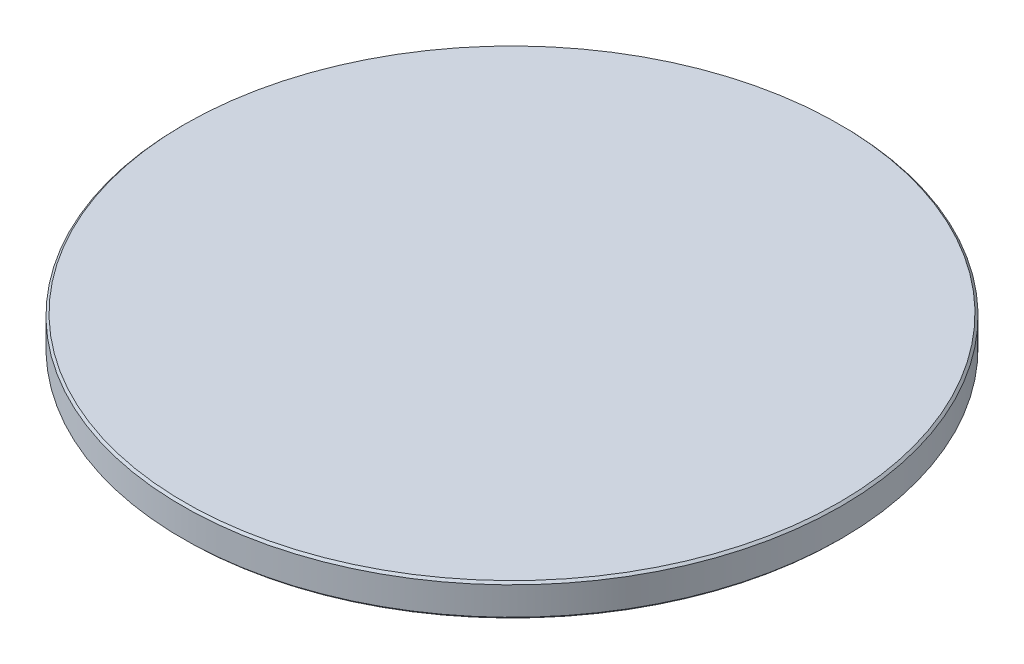
ISO-10303-21;
HEADER;
FILE_DESCRIPTION(('STEP AP214'),'2;1');
FILE_NAME('part.step','',(''),(''),'','','');
FILE_SCHEMA(('AUTOMOTIVE_DESIGN { 1 0 10303 214 1 1 1 1 }'));
ENDSEC;
DATA;
#1=APPLICATION_CONTEXT('core data for automotive mechanical design processes');
#2=APPLICATION_PROTOCOL_DEFINITION('international standard','automotive_design',2000,#1);
#3=PRODUCT_CONTEXT('',#1,'mechanical');
#4=PRODUCT('Part','Part','',(#3));
#5=PRODUCT_RELATED_PRODUCT_CATEGORY('part','',(#4));
#6=PRODUCT_DEFINITION_FORMATION('','',#4);
#7=PRODUCT_DEFINITION_CONTEXT('part definition',#1,'design');
#8=PRODUCT_DEFINITION('design','',#6,#7);
#9=PRODUCT_DEFINITION_SHAPE('','',#8);
#10=(LENGTH_UNIT() NAMED_UNIT(*) SI_UNIT(.MILLI.,.METRE.));
#11=(NAMED_UNIT(*) PLANE_ANGLE_UNIT() SI_UNIT($,.RADIAN.));
#12=(NAMED_UNIT(*) SI_UNIT($,.STERADIAN.) SOLID_ANGLE_UNIT());
#13=UNCERTAINTY_MEASURE_WITH_UNIT(LENGTH_MEASURE(1.E-05),#10,'distance_accuracy_value','');
#14=(GEOMETRIC_REPRESENTATION_CONTEXT(3) GLOBAL_UNCERTAINTY_ASSIGNED_CONTEXT((#13)) GLOBAL_UNIT_ASSIGNED_CONTEXT((#10,
#11,#12)) REPRESENTATION_CONTEXT('',''));
#15=CARTESIAN_POINT('',(0.,0.,0.));
#16=DIRECTION('',(0.,0.,1.));
#17=DIRECTION('',(1.,0.,0.));
#18=AXIS2_PLACEMENT_3D('',#15,#16,#17);
#19=CARTESIAN_POINT('',(0.,3.,0.));
#20=DIRECTION('',(0.,1.,0.));
#21=DIRECTION('',(-1.,0.,0.));
#22=AXIS2_PLACEMENT_3D('',#19,#20,#21);
#23=PLANE('',#22);
#24=CARTESIAN_POINT('',(0.,2.99999999999999,0.));
#25=DIRECTION('',(0.,1.,0.));
#26=DIRECTION('',(-1.,0.,0.));
#27=AXIS2_PLACEMENT_3D('',#24,#25,#26);
#28=CIRCLE('',#27,30.3);
#29=CARTESIAN_POINT('',(-30.3,3.,0.));
#30=VERTEX_POINT('',#29);
#31=EDGE_CURVE('E10',#30,#30,#28,.T.);
#32=ORIENTED_EDGE('',*,*,#31,.T.);
#33=EDGE_LOOP('',(#32));
#34=FACE_BOUND('',#33,.T.);
#35=ADVANCED_FACE('F39',(#34),#23,.T.);
#36=CARTESIAN_POINT('',(0.,2.99999999999999,0.));
#37=DIRECTION('',(0.,-1.,0.));
#38=DIRECTION('',(1.,0.,0.));
#39=AXIS2_PLACEMENT_3D('',#36,#37,#38);
#40=CONICAL_SURFACE('',#39,30.3,0.785398163397444);
#41=CARTESIAN_POINT('',(0.,2.79999999999999,0.));
#42=DIRECTION('',(0.,1.,0.));
#43=DIRECTION('',(-1.,0.,0.));
#44=AXIS2_PLACEMENT_3D('',#41,#42,#43);
#45=CIRCLE('',#44,30.5);
#46=CARTESIAN_POINT('',(-30.5,2.8,0.));
#47=VERTEX_POINT('',#46);
#48=EDGE_CURVE('E46',#47,#47,#45,.T.);
#49=ORIENTED_EDGE('',*,*,#48,.T.);
#50=EDGE_LOOP('',(#49));
#51=FACE_BOUND('',#50,.T.);
#52=ORIENTED_EDGE('',*,*,#31,.F.);
#53=EDGE_LOOP('',(#52));
#54=FACE_BOUND('',#53,.T.);
#55=ADVANCED_FACE('F78',(#51,#54),#40,.T.);
#56=CARTESIAN_POINT('',(0.,3.,0.));
#57=DIRECTION('',(0.,1.,0.));
#58=DIRECTION('',(-1.,0.,0.));
#59=AXIS2_PLACEMENT_3D('',#56,#57,#58);
#60=CYLINDRICAL_SURFACE('',#59,30.5);
#61=CARTESIAN_POINT('',(0.,0.199999999999992,0.));
#62=DIRECTION('',(0.,1.,0.));
#63=DIRECTION('',(-1.,0.,0.));
#64=AXIS2_PLACEMENT_3D('',#61,#62,#63);
#65=CIRCLE('',#64,30.5);
#66=CARTESIAN_POINT('',(-30.5,0.199999999999996,0.));
#67=VERTEX_POINT('',#66);
#68=EDGE_CURVE('E53',#67,#67,#65,.T.);
#69=ORIENTED_EDGE('',*,*,#68,.T.);
#70=EDGE_LOOP('',(#69));
#71=FACE_BOUND('',#70,.T.);
#72=ORIENTED_EDGE('',*,*,#48,.F.);
#73=EDGE_LOOP('',(#72));
#74=FACE_BOUND('',#73,.T.);
#75=ADVANCED_FACE('F75',(#71,#74),#60,.T.);
#76=CARTESIAN_POINT('',(0.,0.199999999999992,0.));
#77=DIRECTION('',(0.,1.,0.));
#78=DIRECTION('',(-1.,0.,0.));
#79=AXIS2_PLACEMENT_3D('',#76,#77,#78);
#80=CONICAL_SURFACE('',#79,30.5,0.785398163397445);
#81=CARTESIAN_POINT('',(0.,0.,0.));
#82=DIRECTION('',(0.,1.,0.));
#83=DIRECTION('',(-1.,0.,0.));
#84=AXIS2_PLACEMENT_3D('',#81,#82,#83);
#85=CIRCLE('',#84,30.3);
#86=CARTESIAN_POINT('',(-30.3,0.,0.));
#87=VERTEX_POINT('',#86);
#88=EDGE_CURVE('E59',#87,#87,#85,.T.);
#89=ORIENTED_EDGE('',*,*,#88,.T.);
#90=EDGE_LOOP('',(#89));
#91=FACE_BOUND('',#90,.T.);
#92=ORIENTED_EDGE('',*,*,#68,.F.);
#93=EDGE_LOOP('',(#92));
#94=FACE_BOUND('',#93,.T.);
#95=ADVANCED_FACE('F66',(#91,#94),#80,.T.);
#96=CARTESIAN_POINT('',(0.,0.,0.));
#97=DIRECTION('',(0.,-1.,0.));
#98=DIRECTION('',(1.,0.,0.));
#99=AXIS2_PLACEMENT_3D('',#96,#97,#98);
#100=PLANE('',#99);
#101=ORIENTED_EDGE('',*,*,#88,.F.);
#102=EDGE_LOOP('',(#101));
#103=FACE_BOUND('',#102,.T.);
#104=ADVANCED_FACE('F69',(#103),#100,.T.);
#105=CLOSED_SHELL('',(#35,#55,#75,#95,#104));
#106=MANIFOLD_SOLID_BREP('B2',#105);
#107=ADVANCED_BREP_SHAPE_REPRESENTATION('',(#18,#106),#14);
#108=SHAPE_DEFINITION_REPRESENTATION(#9,#107);
ENDSEC;
END-ISO-10303-21;
